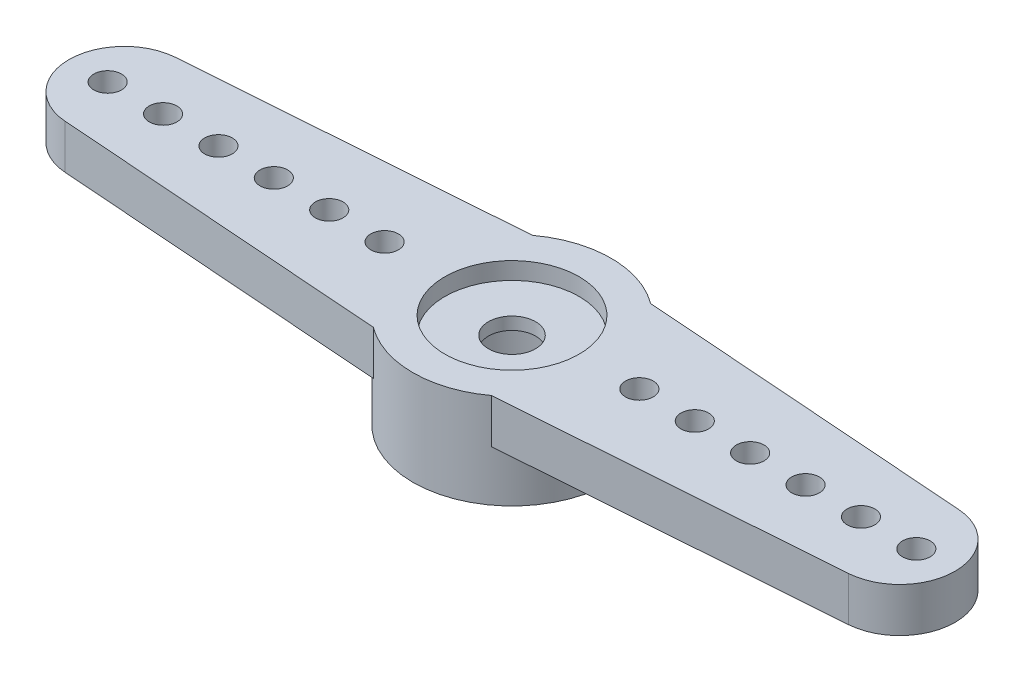
ISO-10303-21;
HEADER;
FILE_DESCRIPTION(('STEP AP214'),'2;1');
FILE_NAME('part.step','',(''),(''),'','','');
FILE_SCHEMA(('AUTOMOTIVE_DESIGN { 1 0 10303 214 1 1 1 1 }'));
ENDSEC;
DATA;
#1=APPLICATION_CONTEXT('core data for automotive mechanical design processes');
#2=APPLICATION_PROTOCOL_DEFINITION('international standard','automotive_design',2000,#1);
#3=PRODUCT_CONTEXT('',#1,'mechanical');
#4=PRODUCT('Part','Part','',(#3));
#5=PRODUCT_RELATED_PRODUCT_CATEGORY('part','',(#4));
#6=PRODUCT_DEFINITION_FORMATION('','',#4);
#7=PRODUCT_DEFINITION_CONTEXT('part definition',#1,'design');
#8=PRODUCT_DEFINITION('design','',#6,#7);
#9=PRODUCT_DEFINITION_SHAPE('','',#8);
#10=(LENGTH_UNIT() NAMED_UNIT(*) SI_UNIT(.MILLI.,.METRE.));
#11=(NAMED_UNIT(*) PLANE_ANGLE_UNIT() SI_UNIT($,.RADIAN.));
#12=(NAMED_UNIT(*) SI_UNIT($,.STERADIAN.) SOLID_ANGLE_UNIT());
#13=UNCERTAINTY_MEASURE_WITH_UNIT(LENGTH_MEASURE(1.E-05),#10,'distance_accuracy_value','');
#14=(GEOMETRIC_REPRESENTATION_CONTEXT(3) GLOBAL_UNCERTAINTY_ASSIGNED_CONTEXT((#13)) GLOBAL_UNIT_ASSIGNED_CONTEXT((#10,
#11,#12)) REPRESENTATION_CONTEXT('',''));
#15=CARTESIAN_POINT('',(0.,0.,0.));
#16=DIRECTION('',(0.,0.,1.));
#17=DIRECTION('',(1.,0.,0.));
#18=AXIS2_PLACEMENT_3D('',#15,#16,#17);
#19=CARTESIAN_POINT('',(3.554,13.2,-3.6));
#20=DIRECTION('',(0.,-1.,0.));
#21=DIRECTION('',(0.,0.,-1.));
#22=AXIS2_PLACEMENT_3D('',#19,#20,#21);
#23=PLANE('',#22);
#24=CARTESIAN_POINT('',(5.9,13.2,-5.9));
#25=DIRECTION('',(0.,1.,0.));
#26=DIRECTION('',(0.,0.,1.));
#27=AXIS2_PLACEMENT_3D('',#24,#25,#26);
#28=CIRCLE('',#27,0.850000000000001);
#29=CARTESIAN_POINT('',(5.9,13.2,-5.05));
#30=VERTEX_POINT('',#29);
#31=EDGE_CURVE('E230',#30,#30,#28,.F.);
#32=ORIENTED_EDGE('',*,*,#31,.F.);
#33=EDGE_LOOP('',(#32));
#34=FACE_BOUND('',#33,.T.);
#35=CARTESIAN_POINT('',(5.9,13.2,-5.9));
#36=DIRECTION('',(0.,-1.,0.));
#37=DIRECTION('',(0.,0.,-1.));
#38=AXIS2_PLACEMENT_3D('',#35,#36,#37);
#39=CIRCLE('',#38,2.3);
#40=CARTESIAN_POINT('',(5.9,13.2,-8.2));
#41=VERTEX_POINT('',#40);
#42=EDGE_CURVE('E21',#41,#41,#39,.F.);
#43=ORIENTED_EDGE('',*,*,#42,.F.);
#44=EDGE_LOOP('',(#43));
#45=FACE_BOUND('',#44,.T.);
#46=ADVANCED_FACE('F17',(#34,#45),#23,.T.);
#47=CARTESIAN_POINT('',(5.9,13.2,-5.9));
#48=DIRECTION('',(0.,-1.,0.));
#49=DIRECTION('',(0.,0.,-1.));
#50=AXIS2_PLACEMENT_3D('',#47,#48,#49);
#51=CYLINDRICAL_SURFACE('',#50,2.3);
#52=ORIENTED_EDGE('',*,*,#42,.T.);
#53=EDGE_LOOP('',(#52));
#54=FACE_BOUND('',#53,.T.);
#55=CARTESIAN_POINT('',(5.9,10.84,-5.9));
#56=DIRECTION('',(0.,-1.,0.));
#57=DIRECTION('',(0.,0.,-1.));
#58=AXIS2_PLACEMENT_3D('',#55,#56,#57);
#59=CIRCLE('',#58,2.3);
#60=CARTESIAN_POINT('',(5.9,10.84,-8.2));
#61=VERTEX_POINT('',#60);
#62=EDGE_CURVE('E228',#61,#61,#59,.F.);
#63=ORIENTED_EDGE('',*,*,#62,.F.);
#64=EDGE_LOOP('',(#63));
#65=FACE_BOUND('',#64,.T.);
#66=ADVANCED_FACE('F237',(#54,#65),#51,.F.);
#67=CARTESIAN_POINT('',(5.9,13.2,-5.9));
#68=DIRECTION('',(0.,1.,0.));
#69=DIRECTION('',(0.,0.,1.));
#70=AXIS2_PLACEMENT_3D('',#67,#68,#69);
#71=CYLINDRICAL_SURFACE('',#70,0.850000000000001);
#72=ORIENTED_EDGE('',*,*,#31,.T.);
#73=EDGE_LOOP('',(#72));
#74=FACE_BOUND('',#73,.T.);
#75=CARTESIAN_POINT('',(5.9,13.65,-5.9));
#76=DIRECTION('',(0.,1.,0.));
#77=DIRECTION('',(0.,0.,1.));
#78=AXIS2_PLACEMENT_3D('',#75,#76,#77);
#79=CIRCLE('',#78,0.850000000000001);
#80=CARTESIAN_POINT('',(5.9,13.65,-5.05));
#81=VERTEX_POINT('',#80);
#82=EDGE_CURVE('E224',#81,#81,#79,.F.);
#83=ORIENTED_EDGE('',*,*,#82,.F.);
#84=EDGE_LOOP('',(#83));
#85=FACE_BOUND('',#84,.T.);
#86=ADVANCED_FACE('F247',(#74,#85),#71,.F.);
#87=CARTESIAN_POINT('',(2.2484,10.84,-2.2484));
#88=DIRECTION('',(0.,-1.,0.));
#89=DIRECTION('',(0.,0.,-1.));
#90=AXIS2_PLACEMENT_3D('',#87,#88,#89);
#91=PLANE('',#90);
#92=ORIENTED_EDGE('',*,*,#62,.T.);
#93=EDGE_LOOP('',(#92));
#94=FACE_BOUND('',#93,.T.);
#95=CARTESIAN_POINT('',(5.9,10.84,-5.9));
#96=DIRECTION('',(0.,1.,0.));
#97=DIRECTION('',(0.,0.,1.));
#98=AXIS2_PLACEMENT_3D('',#95,#96,#97);
#99=CIRCLE('',#98,3.58);
#100=CARTESIAN_POINT('',(5.9,10.84,-2.32));
#101=VERTEX_POINT('',#100);
#102=EDGE_CURVE('E91',#101,#101,#99,.T.);
#103=ORIENTED_EDGE('',*,*,#102,.F.);
#104=EDGE_LOOP('',(#103));
#105=FACE_BOUND('',#104,.T.);
#106=ADVANCED_FACE('F405',(#94,#105),#91,.T.);
#107=CARTESIAN_POINT('',(8.03325455583716,12.67,-3.025));
#108=DIRECTION('',(0.,-1.,0.));
#109=DIRECTION('',(0.,0.,-1.));
#110=AXIS2_PLACEMENT_3D('',#107,#108,#109);
#111=PLANE('',#110);
#112=CARTESIAN_POINT('',(10.5,12.67,-5.9));
#113=DIRECTION('',(0.,-1.,0.));
#114=DIRECTION('',(0.,0.,-1.));
#115=AXIS2_PLACEMENT_3D('',#112,#113,#114);
#116=CIRCLE('',#115,0.500000000000001);
#117=CARTESIAN_POINT('',(10.5,12.67,-6.4));
#118=VERTEX_POINT('',#117);
#119=EDGE_CURVE('E101',#118,#118,#116,.T.);
#120=ORIENTED_EDGE('',*,*,#119,.F.);
#121=EDGE_LOOP('',(#120));
#122=FACE_BOUND('',#121,.T.);
#123=CARTESIAN_POINT('',(14.5,12.67,-5.9));
#124=DIRECTION('',(0.,-1.,0.));
#125=DIRECTION('',(0.,0.,-1.));
#126=AXIS2_PLACEMENT_3D('',#123,#124,#125);
#127=CIRCLE('',#126,0.5);
#128=CARTESIAN_POINT('',(14.5,12.67,-6.4));
#129=VERTEX_POINT('',#128);
#130=EDGE_CURVE('E215',#129,#129,#127,.T.);
#131=ORIENTED_EDGE('',*,*,#130,.F.);
#132=EDGE_LOOP('',(#131));
#133=FACE_BOUND('',#132,.T.);
#134=CARTESIAN_POINT('',(18.5,12.67,-5.9));
#135=DIRECTION('',(0.,-1.,0.));
#136=DIRECTION('',(0.,0.,-1.));
#137=AXIS2_PLACEMENT_3D('',#134,#135,#136);
#138=CIRCLE('',#137,0.499999999999999);
#139=CARTESIAN_POINT('',(18.5,12.67,-6.4));
#140=VERTEX_POINT('',#139);
#141=EDGE_CURVE('E212',#140,#140,#138,.T.);
#142=ORIENTED_EDGE('',*,*,#141,.F.);
#143=EDGE_LOOP('',(#142));
#144=FACE_BOUND('',#143,.T.);
#145=CARTESIAN_POINT('',(20.5,12.67,-5.9));
#146=DIRECTION('',(0.,-1.,0.));
#147=DIRECTION('',(0.,0.,-1.));
#148=AXIS2_PLACEMENT_3D('',#145,#146,#147);
#149=CIRCLE('',#148,0.500000000000002);
#150=CARTESIAN_POINT('',(20.5,12.67,-6.4));
#151=VERTEX_POINT('',#150);
#152=EDGE_CURVE('E209',#151,#151,#149,.T.);
#153=ORIENTED_EDGE('',*,*,#152,.F.);
#154=EDGE_LOOP('',(#153));
#155=FACE_BOUND('',#154,.T.);
#156=CARTESIAN_POINT('',(16.5,12.67,-5.9));
#157=DIRECTION('',(0.,-1.,0.));
#158=DIRECTION('',(0.,0.,-1.));
#159=AXIS2_PLACEMENT_3D('',#156,#157,#158);
#160=CIRCLE('',#159,0.5);
#161=CARTESIAN_POINT('',(16.5,12.67,-6.4));
#162=VERTEX_POINT('',#161);
#163=EDGE_CURVE('E206',#162,#162,#160,.T.);
#164=ORIENTED_EDGE('',*,*,#163,.F.);
#165=EDGE_LOOP('',(#164));
#166=FACE_BOUND('',#165,.T.);
#167=CARTESIAN_POINT('',(12.5,12.67,-5.9));
#168=DIRECTION('',(0.,-1.,0.));
#169=DIRECTION('',(0.,0.,-1.));
#170=AXIS2_PLACEMENT_3D('',#167,#168,#169);
#171=CIRCLE('',#170,0.500000000000001);
#172=CARTESIAN_POINT('',(12.5,12.67,-6.4));
#173=VERTEX_POINT('',#172);
#174=EDGE_CURVE('E203',#173,#173,#171,.T.);
#175=ORIENTED_EDGE('',*,*,#174,.F.);
#176=EDGE_LOOP('',(#175));
#177=FACE_BOUND('',#176,.T.);
#178=DIRECTION('',(-0.997325531387097,0.,-0.0730875122264069));
#179=VECTOR('',#178,1.);
#180=CARTESIAN_POINT('',(14.039714790145,12.67,-8.33482553138709));
#181=LINE('',#180,#179);
#182=CARTESIAN_POINT('',(20.0461750244528,12.67,-7.89465106277419));
#183=VERTEX_POINT('',#182);
#184=CARTESIAN_POINT('',(8.03325455583716,12.67,-8.775));
#185=VERTEX_POINT('',#184);
#186=EDGE_CURVE('E86',#183,#185,#181,.T.);
#187=ORIENTED_EDGE('',*,*,#186,.F.);
#188=CARTESIAN_POINT('',(19.9,12.67,-5.9));
#189=DIRECTION('',(0.,1.,0.));
#190=DIRECTION('',(0.,0.,1.));
#191=AXIS2_PLACEMENT_3D('',#188,#189,#190);
#192=CIRCLE('',#191,2.);
#193=CARTESIAN_POINT('',(20.0461750244528,12.67,-3.9053489372258));
#194=VERTEX_POINT('',#193);
#195=EDGE_CURVE('E105',#194,#183,#192,.T.);
#196=ORIENTED_EDGE('',*,*,#195,.F.);
#197=DIRECTION('',(0.997325531387097,0.,-0.0730875122264059));
#198=VECTOR('',#197,1.);
#199=CARTESIAN_POINT('',(14.039714790145,12.67,-3.4651744686129));
#200=LINE('',#199,#198);
#201=CARTESIAN_POINT('',(8.03325455583716,12.67,-3.025));
#202=VERTEX_POINT('',#201);
#203=EDGE_CURVE('E87',#202,#194,#200,.T.);
#204=ORIENTED_EDGE('',*,*,#203,.F.);
#205=CARTESIAN_POINT('',(5.9,12.67,-5.9));
#206=DIRECTION('',(0.,1.,0.));
#207=DIRECTION('',(0.,0.,1.));
#208=AXIS2_PLACEMENT_3D('',#205,#206,#207);
#209=CIRCLE('',#208,3.58);
#210=EDGE_CURVE('E81',#185,#202,#209,.F.);
#211=ORIENTED_EDGE('',*,*,#210,.F.);
#212=EDGE_LOOP('',(#187,#196,#204,#211));
#213=FACE_BOUND('',#212,.T.);
#214=ADVANCED_FACE('F83',(#122,#133,#144,#155,#166,#177,#213),#111,.T.);
#215=CARTESIAN_POINT('',(3.4265,13.65,-8.325));
#216=DIRECTION('',(0.,1.,0.));
#217=DIRECTION('',(0.,0.,1.));
#218=AXIS2_PLACEMENT_3D('',#215,#216,#217);
#219=PLANE('',#218);
#220=ORIENTED_EDGE('',*,*,#82,.T.);
#221=EDGE_LOOP('',(#220));
#222=FACE_BOUND('',#221,.T.);
#223=CARTESIAN_POINT('',(5.9,13.65,-5.9));
#224=DIRECTION('',(0.,-1.,0.));
#225=DIRECTION('',(0.,0.,-1.));
#226=AXIS2_PLACEMENT_3D('',#223,#224,#225);
#227=CIRCLE('',#226,2.425);
#228=CARTESIAN_POINT('',(5.9,13.65,-8.325));
#229=VERTEX_POINT('',#228);
#230=EDGE_CURVE('E200',#229,#229,#227,.T.);
#231=ORIENTED_EDGE('',*,*,#230,.F.);
#232=EDGE_LOOP('',(#231));
#233=FACE_BOUND('',#232,.T.);
#234=ADVANCED_FACE('F300',(#222,#233),#219,.T.);
#235=CARTESIAN_POINT('',(-8.24617502445281,14.27,-7.8946510627742));
#236=DIRECTION('',(-0.0730875122264059,0.,-0.997325531387097));
#237=DIRECTION('',(0.997325531387097,0.,-0.0730875122264059));
#238=AXIS2_PLACEMENT_3D('',#235,#236,#237);
#239=PLANE('',#238);
#240=DIRECTION('',(0.997325531387097,0.,-0.073087512226406));
#241=VECTOR('',#240,1.);
#242=CARTESIAN_POINT('',(-8.2461750244528,12.67,-7.8946510627742));
#243=LINE('',#242,#241);
#244=CARTESIAN_POINT('',(-8.24617502445281,12.67,-7.8946510627742));
#245=VERTEX_POINT('',#244);
#246=CARTESIAN_POINT('',(3.76674544416284,12.67,-8.775));
#247=VERTEX_POINT('',#246);
#248=EDGE_CURVE('E197',#245,#247,#243,.T.);
#249=ORIENTED_EDGE('',*,*,#248,.F.);
#250=DIRECTION('',(0.,-1.,0.));
#251=VECTOR('',#250,1.);
#252=CARTESIAN_POINT('',(-8.24617502445281,13.47,-7.8946510627742));
#253=LINE('',#252,#251);
#254=CARTESIAN_POINT('',(-8.24617502445281,14.27,-7.8946510627742));
#255=VERTEX_POINT('',#254);
#256=EDGE_CURVE('E227',#255,#245,#253,.T.);
#257=ORIENTED_EDGE('',*,*,#256,.F.);
#258=DIRECTION('',(-0.997325531387097,0.,0.073087512226406));
#259=VECTOR('',#258,1.);
#260=CARTESIAN_POINT('',(3.76674544416284,14.27,-8.775));
#261=LINE('',#260,#259);
#262=CARTESIAN_POINT('',(3.76674544416284,14.27,-8.775));
#263=VERTEX_POINT('',#262);
#264=EDGE_CURVE('E169',#263,#255,#261,.T.);
#265=ORIENTED_EDGE('',*,*,#264,.F.);
#266=DIRECTION('',(0.,1.,0.));
#267=VECTOR('',#266,1.);
#268=CARTESIAN_POINT('',(3.76674544416284,12.555,-8.775));
#269=LINE('',#268,#267);
#270=EDGE_CURVE('E109',#247,#263,#269,.T.);
#271=ORIENTED_EDGE('',*,*,#270,.F.);
#272=EDGE_LOOP('',(#249,#257,#265,#271));
#273=FACE_BOUND('',#272,.T.);
#274=ADVANCED_FACE('F298',(#273),#239,.T.);
#275=CARTESIAN_POINT('',(-8.09999999999999,12.67,-5.9));
#276=DIRECTION('',(0.,1.,0.));
#277=DIRECTION('',(0.,0.,1.));
#278=AXIS2_PLACEMENT_3D('',#275,#276,#277);
#279=CYLINDRICAL_SURFACE('',#278,2.);
#280=CARTESIAN_POINT('',(-8.09999999999999,12.67,-5.9));
#281=DIRECTION('',(0.,1.,0.));
#282=DIRECTION('',(0.,0.,1.));
#283=AXIS2_PLACEMENT_3D('',#280,#281,#282);
#284=CIRCLE('',#283,2.);
#285=CARTESIAN_POINT('',(-8.24617502445281,12.67,-3.90534893722581));
#286=VERTEX_POINT('',#285);
#287=EDGE_CURVE('E188',#286,#245,#284,.F.);
#288=ORIENTED_EDGE('',*,*,#287,.F.);
#289=DIRECTION('',(0.,-1.,0.));
#290=VECTOR('',#289,1.);
#291=CARTESIAN_POINT('',(-8.24617502445281,13.47,-3.90534893722581));
#292=LINE('',#291,#290);
#293=CARTESIAN_POINT('',(-8.24617502445281,14.27,-3.90534893722581));
#294=VERTEX_POINT('',#293);
#295=EDGE_CURVE('E223',#294,#286,#292,.T.);
#296=ORIENTED_EDGE('',*,*,#295,.F.);
#297=CARTESIAN_POINT('',(-8.09999999999999,14.27,-5.9));
#298=DIRECTION('',(0.,1.,0.));
#299=DIRECTION('',(0.,0.,1.));
#300=AXIS2_PLACEMENT_3D('',#297,#298,#299);
#301=CIRCLE('',#300,2.);
#302=EDGE_CURVE('E166',#255,#294,#301,.T.);
#303=ORIENTED_EDGE('',*,*,#302,.F.);
#304=ORIENTED_EDGE('',*,*,#256,.T.);
#305=EDGE_LOOP('',(#288,#296,#303,#304));
#306=FACE_BOUND('',#305,.T.);
#307=ADVANCED_FACE('F286',(#306),#279,.T.);
#308=CARTESIAN_POINT('',(3.76674544416284,14.27,-3.025));
#309=DIRECTION('',(-0.0730875122264067,0.,0.997325531387097));
#310=DIRECTION('',(-0.997325531387097,0.,-0.0730875122264067));
#311=AXIS2_PLACEMENT_3D('',#308,#309,#310);
#312=PLANE('',#311);
#313=DIRECTION('',(-0.997325531387097,0.,-0.0730875122264068));
#314=VECTOR('',#313,1.);
#315=CARTESIAN_POINT('',(3.76674544416284,12.67,-3.025));
#316=LINE('',#315,#314);
#317=CARTESIAN_POINT('',(3.76674544416284,12.67,-3.025));
#318=VERTEX_POINT('',#317);
#319=EDGE_CURVE('E191',#318,#286,#316,.T.);
#320=ORIENTED_EDGE('',*,*,#319,.F.);
#321=DIRECTION('',(0.,-1.,0.));
#322=VECTOR('',#321,1.);
#323=CARTESIAN_POINT('',(3.76674544416284,12.555,-3.025));
#324=LINE('',#323,#322);
#325=CARTESIAN_POINT('',(3.76674544416284,14.27,-3.025));
#326=VERTEX_POINT('',#325);
#327=EDGE_CURVE('E90',#326,#318,#324,.T.);
#328=ORIENTED_EDGE('',*,*,#327,.F.);
#329=DIRECTION('',(0.997325531387097,0.,0.0730875122264067));
#330=VECTOR('',#329,1.);
#331=CARTESIAN_POINT('',(-8.2461750244528,14.27,-3.90534893722581));
#332=LINE('',#331,#330);
#333=EDGE_CURVE('E163',#294,#326,#332,.T.);
#334=ORIENTED_EDGE('',*,*,#333,.F.);
#335=ORIENTED_EDGE('',*,*,#295,.T.);
#336=EDGE_LOOP('',(#320,#328,#334,#335));
#337=FACE_BOUND('',#336,.T.);
#338=ADVANCED_FACE('F279',(#337),#312,.T.);
#339=CARTESIAN_POINT('',(5.9,10.84,-5.9));
#340=DIRECTION('',(0.,1.,0.));
#341=DIRECTION('',(0.,0.,1.));
#342=AXIS2_PLACEMENT_3D('',#339,#340,#341);
#343=CYLINDRICAL_SURFACE('',#342,3.58);
#344=CARTESIAN_POINT('',(5.9,14.27,-5.9));
#345=DIRECTION('',(0.,1.,0.));
#346=DIRECTION('',(0.,0.,1.));
#347=AXIS2_PLACEMENT_3D('',#344,#345,#346);
#348=CIRCLE('',#347,3.58);
#349=CARTESIAN_POINT('',(8.03325455583716,14.27,-8.775));
#350=VERTEX_POINT('',#349);
#351=EDGE_CURVE('E98',#350,#263,#348,.T.);
#352=ORIENTED_EDGE('',*,*,#351,.F.);
#353=DIRECTION('',(0.,1.,0.));
#354=VECTOR('',#353,1.);
#355=CARTESIAN_POINT('',(8.03325455583716,13.47,-8.775));
#356=LINE('',#355,#354);
#357=EDGE_CURVE('E94',#185,#350,#356,.T.);
#358=ORIENTED_EDGE('',*,*,#357,.F.);
#359=ORIENTED_EDGE('',*,*,#210,.T.);
#360=DIRECTION('',(0.,-1.,0.));
#361=VECTOR('',#360,1.);
#362=CARTESIAN_POINT('',(8.03325455583716,13.47,-3.025));
#363=LINE('',#362,#361);
#364=CARTESIAN_POINT('',(8.03325455583716,14.27,-3.025));
#365=VERTEX_POINT('',#364);
#366=EDGE_CURVE('E112',#365,#202,#363,.T.);
#367=ORIENTED_EDGE('',*,*,#366,.F.);
#368=CARTESIAN_POINT('',(5.9,14.27,-5.9));
#369=DIRECTION('',(0.,1.,0.));
#370=DIRECTION('',(0.,0.,1.));
#371=AXIS2_PLACEMENT_3D('',#368,#369,#370);
#372=CIRCLE('',#371,3.58);
#373=EDGE_CURVE('E160',#326,#365,#372,.T.);
#374=ORIENTED_EDGE('',*,*,#373,.F.);
#375=ORIENTED_EDGE('',*,*,#327,.T.);
#376=CARTESIAN_POINT('',(5.9,12.67,-5.9));
#377=DIRECTION('',(0.,1.,0.));
#378=DIRECTION('',(0.,0.,1.));
#379=AXIS2_PLACEMENT_3D('',#376,#377,#378);
#380=CIRCLE('',#379,3.58);
#381=EDGE_CURVE('E194',#247,#318,#380,.T.);
#382=ORIENTED_EDGE('',*,*,#381,.F.);
#383=ORIENTED_EDGE('',*,*,#270,.T.);
#384=EDGE_LOOP('',(#352,#358,#359,#367,#374,#375,#382,#383));
#385=FACE_BOUND('',#384,.T.);
#386=ORIENTED_EDGE('',*,*,#102,.T.);
#387=EDGE_LOOP('',(#386));
#388=FACE_BOUND('',#387,.T.);
#389=ADVANCED_FACE('F95',(#385,#388),#343,.T.);
#390=CARTESIAN_POINT('',(20.0461750244528,14.27,-3.9053489372258));
#391=DIRECTION('',(0.0730875122264059,0.,0.997325531387097));
#392=DIRECTION('',(-0.997325531387097,0.,0.0730875122264059));
#393=AXIS2_PLACEMENT_3D('',#390,#391,#392);
#394=PLANE('',#393);
#395=ORIENTED_EDGE('',*,*,#203,.T.);
#396=DIRECTION('',(0.,-1.,0.));
#397=VECTOR('',#396,1.);
#398=CARTESIAN_POINT('',(20.0461750244528,13.47,-3.9053489372258));
#399=LINE('',#398,#397);
#400=CARTESIAN_POINT('',(20.0461750244528,14.27,-3.9053489372258));
#401=VERTEX_POINT('',#400);
#402=EDGE_CURVE('E111',#401,#194,#399,.T.);
#403=ORIENTED_EDGE('',*,*,#402,.F.);
#404=DIRECTION('',(0.997325531387097,0.,-0.0730875122264058));
#405=VECTOR('',#404,1.);
#406=CARTESIAN_POINT('',(8.03325455583716,14.27,-3.025));
#407=LINE('',#406,#405);
#408=EDGE_CURVE('E157',#365,#401,#407,.T.);
#409=ORIENTED_EDGE('',*,*,#408,.F.);
#410=ORIENTED_EDGE('',*,*,#366,.T.);
#411=EDGE_LOOP('',(#395,#403,#409,#410));
#412=FACE_BOUND('',#411,.T.);
#413=ADVANCED_FACE('F296',(#412),#394,.T.);
#414=CARTESIAN_POINT('',(19.9,12.67,-5.9));
#415=DIRECTION('',(0.,1.,0.));
#416=DIRECTION('',(0.,0.,1.));
#417=AXIS2_PLACEMENT_3D('',#414,#415,#416);
#418=CYLINDRICAL_SURFACE('',#417,2.);
#419=ORIENTED_EDGE('',*,*,#195,.T.);
#420=DIRECTION('',(0.,-1.,0.));
#421=VECTOR('',#420,1.);
#422=CARTESIAN_POINT('',(20.0461750244528,13.47,-7.89465106277419));
#423=LINE('',#422,#421);
#424=CARTESIAN_POINT('',(20.0461750244528,14.27,-7.89465106277419));
#425=VERTEX_POINT('',#424);
#426=EDGE_CURVE('E36',#425,#183,#423,.T.);
#427=ORIENTED_EDGE('',*,*,#426,.F.);
#428=CARTESIAN_POINT('',(19.9,14.27,-5.9));
#429=DIRECTION('',(0.,1.,0.));
#430=DIRECTION('',(0.,0.,1.));
#431=AXIS2_PLACEMENT_3D('',#428,#429,#430);
#432=CIRCLE('',#431,2.);
#433=EDGE_CURVE('E154',#401,#425,#432,.T.);
#434=ORIENTED_EDGE('',*,*,#433,.F.);
#435=ORIENTED_EDGE('',*,*,#402,.T.);
#436=EDGE_LOOP('',(#419,#427,#434,#435));
#437=FACE_BOUND('',#436,.T.);
#438=ADVANCED_FACE('F293',(#437),#418,.T.);
#439=CARTESIAN_POINT('',(8.03325455583716,14.27,-8.775));
#440=DIRECTION('',(0.0730875122264069,0.,-0.997325531387097));
#441=DIRECTION('',(0.997325531387097,0.,0.0730875122264069));
#442=AXIS2_PLACEMENT_3D('',#439,#440,#441);
#443=PLANE('',#442);
#444=ORIENTED_EDGE('',*,*,#186,.T.);
#445=ORIENTED_EDGE('',*,*,#357,.T.);
#446=DIRECTION('',(-0.997325531387097,0.,-0.0730875122264067));
#447=VECTOR('',#446,1.);
#448=CARTESIAN_POINT('',(20.0461750244528,14.27,-7.89465106277419));
#449=LINE('',#448,#447);
#450=EDGE_CURVE('E152',#425,#350,#449,.T.);
#451=ORIENTED_EDGE('',*,*,#450,.F.);
#452=ORIENTED_EDGE('',*,*,#426,.T.);
#453=EDGE_LOOP('',(#444,#445,#451,#452));
#454=FACE_BOUND('',#453,.T.);
#455=ADVANCED_FACE('F103',(#454),#443,.T.);
#456=CARTESIAN_POINT('',(-2.7,14.27,-5.9));
#457=DIRECTION('',(0.,-1.,0.));
#458=DIRECTION('',(0.,0.,-1.));
#459=AXIS2_PLACEMENT_3D('',#456,#457,#458);
#460=CYLINDRICAL_SURFACE('',#459,0.5);
#461=CARTESIAN_POINT('',(-2.7,14.27,-5.9));
#462=DIRECTION('',(0.,-1.,0.));
#463=DIRECTION('',(0.,0.,-1.));
#464=AXIS2_PLACEMENT_3D('',#461,#462,#463);
#465=CIRCLE('',#464,0.5);
#466=CARTESIAN_POINT('',(-2.7,14.27,-6.4));
#467=VERTEX_POINT('',#466);
#468=EDGE_CURVE('E149',#467,#467,#465,.T.);
#469=ORIENTED_EDGE('',*,*,#468,.F.);
#470=EDGE_LOOP('',(#469));
#471=FACE_BOUND('',#470,.T.);
#472=CARTESIAN_POINT('',(-2.7,12.67,-5.9));
#473=DIRECTION('',(0.,-1.,0.));
#474=DIRECTION('',(0.,0.,-1.));
#475=AXIS2_PLACEMENT_3D('',#472,#473,#474);
#476=CIRCLE('',#475,0.5);
#477=CARTESIAN_POINT('',(-2.7,12.67,-6.4));
#478=VERTEX_POINT('',#477);
#479=EDGE_CURVE('E173',#478,#478,#476,.F.);
#480=ORIENTED_EDGE('',*,*,#479,.F.);
#481=EDGE_LOOP('',(#480));
#482=FACE_BOUND('',#481,.T.);
#483=ADVANCED_FACE('F321',(#471,#482),#460,.F.);
#484=CARTESIAN_POINT('',(-6.7,14.27,-5.9));
#485=DIRECTION('',(0.,-1.,0.));
#486=DIRECTION('',(0.,0.,-1.));
#487=AXIS2_PLACEMENT_3D('',#484,#485,#486);
#488=CYLINDRICAL_SURFACE('',#487,0.500000000000001);
#489=CARTESIAN_POINT('',(-6.7,14.27,-5.9));
#490=DIRECTION('',(0.,-1.,0.));
#491=DIRECTION('',(0.,0.,-1.));
#492=AXIS2_PLACEMENT_3D('',#489,#490,#491);
#493=CIRCLE('',#492,0.500000000000001);
#494=CARTESIAN_POINT('',(-6.7,14.27,-6.4));
#495=VERTEX_POINT('',#494);
#496=EDGE_CURVE('E146',#495,#495,#493,.T.);
#497=ORIENTED_EDGE('',*,*,#496,.F.);
#498=EDGE_LOOP('',(#497));
#499=FACE_BOUND('',#498,.T.);
#500=CARTESIAN_POINT('',(-6.7,12.67,-5.9));
#501=DIRECTION('',(0.,-1.,0.));
#502=DIRECTION('',(0.,0.,-1.));
#503=AXIS2_PLACEMENT_3D('',#500,#501,#502);
#504=CIRCLE('',#503,0.500000000000001);
#505=CARTESIAN_POINT('',(-6.7,12.67,-6.4));
#506=VERTEX_POINT('',#505);
#507=EDGE_CURVE('E176',#506,#506,#504,.F.);
#508=ORIENTED_EDGE('',*,*,#507,.F.);
#509=EDGE_LOOP('',(#508));
#510=FACE_BOUND('',#509,.T.);
#511=ADVANCED_FACE('F324',(#499,#510),#488,.F.);
#512=CARTESIAN_POINT('',(-8.7,14.27,-5.9));
#513=DIRECTION('',(0.,-1.,0.));
#514=DIRECTION('',(0.,0.,-1.));
#515=AXIS2_PLACEMENT_3D('',#512,#513,#514);
#516=CYLINDRICAL_SURFACE('',#515,0.500000000000001);
#517=CARTESIAN_POINT('',(-8.7,14.27,-5.9));
#518=DIRECTION('',(0.,-1.,0.));
#519=DIRECTION('',(0.,0.,-1.));
#520=AXIS2_PLACEMENT_3D('',#517,#518,#519);
#521=CIRCLE('',#520,0.500000000000001);
#522=CARTESIAN_POINT('',(-8.7,14.27,-6.4));
#523=VERTEX_POINT('',#522);
#524=EDGE_CURVE('E143',#523,#523,#521,.T.);
#525=ORIENTED_EDGE('',*,*,#524,.F.);
#526=EDGE_LOOP('',(#525));
#527=FACE_BOUND('',#526,.T.);
#528=CARTESIAN_POINT('',(-8.7,12.67,-5.9));
#529=DIRECTION('',(0.,-1.,0.));
#530=DIRECTION('',(0.,0.,-1.));
#531=AXIS2_PLACEMENT_3D('',#528,#529,#530);
#532=CIRCLE('',#531,0.500000000000001);
#533=CARTESIAN_POINT('',(-8.7,12.67,-6.4));
#534=VERTEX_POINT('',#533);
#535=EDGE_CURVE('E179',#534,#534,#532,.F.);
#536=ORIENTED_EDGE('',*,*,#535,.F.);
#537=EDGE_LOOP('',(#536));
#538=FACE_BOUND('',#537,.T.);
#539=ADVANCED_FACE('F328',(#527,#538),#516,.F.);
#540=CARTESIAN_POINT('',(-4.7,14.27,-5.9));
#541=DIRECTION('',(0.,-1.,0.));
#542=DIRECTION('',(0.,0.,-1.));
#543=AXIS2_PLACEMENT_3D('',#540,#541,#542);
#544=CYLINDRICAL_SURFACE('',#543,0.5);
#545=CARTESIAN_POINT('',(-4.7,14.27,-5.9));
#546=DIRECTION('',(0.,-1.,0.));
#547=DIRECTION('',(0.,0.,-1.));
#548=AXIS2_PLACEMENT_3D('',#545,#546,#547);
#549=CIRCLE('',#548,0.5);
#550=CARTESIAN_POINT('',(-4.7,14.27,-6.4));
#551=VERTEX_POINT('',#550);
#552=EDGE_CURVE('E140',#551,#551,#549,.T.);
#553=ORIENTED_EDGE('',*,*,#552,.F.);
#554=EDGE_LOOP('',(#553));
#555=FACE_BOUND('',#554,.T.);
#556=CARTESIAN_POINT('',(-4.7,12.67,-5.9));
#557=DIRECTION('',(0.,-1.,0.));
#558=DIRECTION('',(0.,0.,-1.));
#559=AXIS2_PLACEMENT_3D('',#556,#557,#558);
#560=CIRCLE('',#559,0.5);
#561=CARTESIAN_POINT('',(-4.7,12.67,-6.4));
#562=VERTEX_POINT('',#561);
#563=EDGE_CURVE('E182',#562,#562,#560,.F.);
#564=ORIENTED_EDGE('',*,*,#563,.F.);
#565=EDGE_LOOP('',(#564));
#566=FACE_BOUND('',#565,.T.);
#567=ADVANCED_FACE('F332',(#555,#566),#544,.F.);
#568=CARTESIAN_POINT('',(-0.699999999999997,14.27,-5.9));
#569=DIRECTION('',(0.,-1.,0.));
#570=DIRECTION('',(0.,0.,-1.));
#571=AXIS2_PLACEMENT_3D('',#568,#569,#570);
#572=CYLINDRICAL_SURFACE('',#571,0.500000000000001);
#573=CARTESIAN_POINT('',(-0.699999999999997,14.27,-5.9));
#574=DIRECTION('',(0.,-1.,0.));
#575=DIRECTION('',(0.,0.,-1.));
#576=AXIS2_PLACEMENT_3D('',#573,#574,#575);
#577=CIRCLE('',#576,0.500000000000001);
#578=CARTESIAN_POINT('',(-0.699999999999997,14.27,-6.4));
#579=VERTEX_POINT('',#578);
#580=EDGE_CURVE('E137',#579,#579,#577,.T.);
#581=ORIENTED_EDGE('',*,*,#580,.F.);
#582=EDGE_LOOP('',(#581));
#583=FACE_BOUND('',#582,.T.);
#584=CARTESIAN_POINT('',(-0.699999999999997,12.67,-5.9));
#585=DIRECTION('',(0.,-1.,0.));
#586=DIRECTION('',(0.,0.,-1.));
#587=AXIS2_PLACEMENT_3D('',#584,#585,#586);
#588=CIRCLE('',#587,0.500000000000001);
#589=CARTESIAN_POINT('',(-0.699999999999997,12.67,-6.4));
#590=VERTEX_POINT('',#589);
#591=EDGE_CURVE('E185',#590,#590,#588,.F.);
#592=ORIENTED_EDGE('',*,*,#591,.F.);
#593=EDGE_LOOP('',(#592));
#594=FACE_BOUND('',#593,.T.);
#595=ADVANCED_FACE('F336',(#583,#594),#572,.F.);
#596=CARTESIAN_POINT('',(10.5,14.27,-5.9));
#597=DIRECTION('',(0.,-1.,0.));
#598=DIRECTION('',(0.,0.,-1.));
#599=AXIS2_PLACEMENT_3D('',#596,#597,#598);
#600=CYLINDRICAL_SURFACE('',#599,0.500000000000001);
#601=CARTESIAN_POINT('',(10.5,14.27,-5.9));
#602=DIRECTION('',(0.,-1.,0.));
#603=DIRECTION('',(0.,0.,-1.));
#604=AXIS2_PLACEMENT_3D('',#601,#602,#603);
#605=CIRCLE('',#604,0.500000000000001);
#606=CARTESIAN_POINT('',(10.5,14.27,-6.4));
#607=VERTEX_POINT('',#606);
#608=EDGE_CURVE('E134',#607,#607,#605,.T.);
#609=ORIENTED_EDGE('',*,*,#608,.F.);
#610=EDGE_LOOP('',(#609));
#611=FACE_BOUND('',#610,.T.);
#612=ORIENTED_EDGE('',*,*,#119,.T.);
#613=EDGE_LOOP('',(#612));
#614=FACE_BOUND('',#613,.T.);
#615=ADVANCED_FACE('F340',(#611,#614),#600,.F.);
#616=CARTESIAN_POINT('',(14.5,14.27,-5.9));
#617=DIRECTION('',(0.,-1.,0.));
#618=DIRECTION('',(0.,0.,-1.));
#619=AXIS2_PLACEMENT_3D('',#616,#617,#618);
#620=CYLINDRICAL_SURFACE('',#619,0.5);
#621=CARTESIAN_POINT('',(14.5,14.27,-5.9));
#622=DIRECTION('',(0.,-1.,0.));
#623=DIRECTION('',(0.,0.,-1.));
#624=AXIS2_PLACEMENT_3D('',#621,#622,#623);
#625=CIRCLE('',#624,0.5);
#626=CARTESIAN_POINT('',(14.5,14.27,-6.4));
#627=VERTEX_POINT('',#626);
#628=EDGE_CURVE('E131',#627,#627,#625,.T.);
#629=ORIENTED_EDGE('',*,*,#628,.F.);
#630=EDGE_LOOP('',(#629));
#631=FACE_BOUND('',#630,.T.);
#632=ORIENTED_EDGE('',*,*,#130,.T.);
#633=EDGE_LOOP('',(#632));
#634=FACE_BOUND('',#633,.T.);
#635=ADVANCED_FACE('F344',(#631,#634),#620,.F.);
#636=CARTESIAN_POINT('',(18.5,14.27,-5.9));
#637=DIRECTION('',(0.,-1.,0.));
#638=DIRECTION('',(0.,0.,-1.));
#639=AXIS2_PLACEMENT_3D('',#636,#637,#638);
#640=CYLINDRICAL_SURFACE('',#639,0.499999999999999);
#641=CARTESIAN_POINT('',(18.5,14.27,-5.9));
#642=DIRECTION('',(0.,-1.,0.));
#643=DIRECTION('',(0.,0.,-1.));
#644=AXIS2_PLACEMENT_3D('',#641,#642,#643);
#645=CIRCLE('',#644,0.499999999999999);
#646=CARTESIAN_POINT('',(18.5,14.27,-6.4));
#647=VERTEX_POINT('',#646);
#648=EDGE_CURVE('E128',#647,#647,#645,.T.);
#649=ORIENTED_EDGE('',*,*,#648,.F.);
#650=EDGE_LOOP('',(#649));
#651=FACE_BOUND('',#650,.T.);
#652=ORIENTED_EDGE('',*,*,#141,.T.);
#653=EDGE_LOOP('',(#652));
#654=FACE_BOUND('',#653,.T.);
#655=ADVANCED_FACE('F348',(#651,#654),#640,.F.);
#656=CARTESIAN_POINT('',(20.5,14.27,-5.9));
#657=DIRECTION('',(0.,-1.,0.));
#658=DIRECTION('',(0.,0.,-1.));
#659=AXIS2_PLACEMENT_3D('',#656,#657,#658);
#660=CYLINDRICAL_SURFACE('',#659,0.500000000000002);
#661=CARTESIAN_POINT('',(20.5,14.27,-5.9));
#662=DIRECTION('',(0.,-1.,0.));
#663=DIRECTION('',(0.,0.,-1.));
#664=AXIS2_PLACEMENT_3D('',#661,#662,#663);
#665=CIRCLE('',#664,0.500000000000002);
#666=CARTESIAN_POINT('',(20.5,14.27,-6.4));
#667=VERTEX_POINT('',#666);
#668=EDGE_CURVE('E125',#667,#667,#665,.T.);
#669=ORIENTED_EDGE('',*,*,#668,.F.);
#670=EDGE_LOOP('',(#669));
#671=FACE_BOUND('',#670,.T.);
#672=ORIENTED_EDGE('',*,*,#152,.T.);
#673=EDGE_LOOP('',(#672));
#674=FACE_BOUND('',#673,.T.);
#675=ADVANCED_FACE('F352',(#671,#674),#660,.F.);
#676=CARTESIAN_POINT('',(16.5,14.27,-5.9));
#677=DIRECTION('',(0.,-1.,0.));
#678=DIRECTION('',(0.,0.,-1.));
#679=AXIS2_PLACEMENT_3D('',#676,#677,#678);
#680=CYLINDRICAL_SURFACE('',#679,0.5);
#681=CARTESIAN_POINT('',(16.5,14.27,-5.9));
#682=DIRECTION('',(0.,-1.,0.));
#683=DIRECTION('',(0.,0.,-1.));
#684=AXIS2_PLACEMENT_3D('',#681,#682,#683);
#685=CIRCLE('',#684,0.5);
#686=CARTESIAN_POINT('',(16.5,14.27,-6.4));
#687=VERTEX_POINT('',#686);
#688=EDGE_CURVE('E122',#687,#687,#685,.T.);
#689=ORIENTED_EDGE('',*,*,#688,.F.);
#690=EDGE_LOOP('',(#689));
#691=FACE_BOUND('',#690,.T.);
#692=ORIENTED_EDGE('',*,*,#163,.T.);
#693=EDGE_LOOP('',(#692));
#694=FACE_BOUND('',#693,.T.);
#695=ADVANCED_FACE('F356',(#691,#694),#680,.F.);
#696=CARTESIAN_POINT('',(12.5,14.27,-5.9));
#697=DIRECTION('',(0.,-1.,0.));
#698=DIRECTION('',(0.,0.,-1.));
#699=AXIS2_PLACEMENT_3D('',#696,#697,#698);
#700=CYLINDRICAL_SURFACE('',#699,0.500000000000001);
#701=CARTESIAN_POINT('',(12.5,14.27,-5.9));
#702=DIRECTION('',(0.,-1.,0.));
#703=DIRECTION('',(0.,0.,-1.));
#704=AXIS2_PLACEMENT_3D('',#701,#702,#703);
#705=CIRCLE('',#704,0.500000000000001);
#706=CARTESIAN_POINT('',(12.5,14.27,-6.4));
#707=VERTEX_POINT('',#706);
#708=EDGE_CURVE('E119',#707,#707,#705,.T.);
#709=ORIENTED_EDGE('',*,*,#708,.F.);
#710=EDGE_LOOP('',(#709));
#711=FACE_BOUND('',#710,.T.);
#712=ORIENTED_EDGE('',*,*,#174,.T.);
#713=EDGE_LOOP('',(#712));
#714=FACE_BOUND('',#713,.T.);
#715=ADVANCED_FACE('F360',(#711,#714),#700,.F.);
#716=CARTESIAN_POINT('',(5.9,14.27,-5.9));
#717=DIRECTION('',(0.,-1.,0.));
#718=DIRECTION('',(0.,0.,-1.));
#719=AXIS2_PLACEMENT_3D('',#716,#717,#718);
#720=CYLINDRICAL_SURFACE('',#719,2.425);
#721=ORIENTED_EDGE('',*,*,#230,.T.);
#722=EDGE_LOOP('',(#721));
#723=FACE_BOUND('',#722,.T.);
#724=CARTESIAN_POINT('',(5.9,14.27,-5.9));
#725=DIRECTION('',(0.,-1.,0.));
#726=DIRECTION('',(0.,0.,-1.));
#727=AXIS2_PLACEMENT_3D('',#724,#725,#726);
#728=CIRCLE('',#727,2.425);
#729=CARTESIAN_POINT('',(5.9,14.27,-8.325));
#730=VERTEX_POINT('',#729);
#731=EDGE_CURVE('E116',#730,#730,#728,.T.);
#732=ORIENTED_EDGE('',*,*,#731,.F.);
#733=EDGE_LOOP('',(#732));
#734=FACE_BOUND('',#733,.T.);
#735=ADVANCED_FACE('F263',(#723,#734),#720,.F.);
#736=CARTESIAN_POINT('',(-10.2386674544416,12.67,-3.025));
#737=DIRECTION('',(0.,-1.,0.));
#738=DIRECTION('',(0.,0.,-1.));
#739=AXIS2_PLACEMENT_3D('',#736,#737,#738);
#740=PLANE('',#739);
#741=CARTESIAN_POINT('',(1.3,12.67,-5.9));
#742=DIRECTION('',(0.,-1.,0.));
#743=DIRECTION('',(0.,0.,-1.));
#744=AXIS2_PLACEMENT_3D('',#741,#742,#743);
#745=CIRCLE('',#744,0.5);
#746=CARTESIAN_POINT('',(1.3,12.67,-6.4));
#747=VERTEX_POINT('',#746);
#748=EDGE_CURVE('E27',#747,#747,#745,.T.);
#749=ORIENTED_EDGE('',*,*,#748,.F.);
#750=EDGE_LOOP('',(#749));
#751=FACE_BOUND('',#750,.T.);
#752=ORIENTED_EDGE('',*,*,#479,.T.);
#753=EDGE_LOOP('',(#752));
#754=FACE_BOUND('',#753,.T.);
#755=ORIENTED_EDGE('',*,*,#507,.T.);
#756=EDGE_LOOP('',(#755));
#757=FACE_BOUND('',#756,.T.);
#758=ORIENTED_EDGE('',*,*,#535,.T.);
#759=EDGE_LOOP('',(#758));
#760=FACE_BOUND('',#759,.T.);
#761=ORIENTED_EDGE('',*,*,#563,.T.);
#762=EDGE_LOOP('',(#761));
#763=FACE_BOUND('',#762,.T.);
#764=ORIENTED_EDGE('',*,*,#591,.T.);
#765=EDGE_LOOP('',(#764));
#766=FACE_BOUND('',#765,.T.);
#767=ORIENTED_EDGE('',*,*,#319,.T.);
#768=ORIENTED_EDGE('',*,*,#287,.T.);
#769=ORIENTED_EDGE('',*,*,#248,.T.);
#770=ORIENTED_EDGE('',*,*,#381,.T.);
#771=EDGE_LOOP('',(#767,#768,#769,#770));
#772=FACE_BOUND('',#771,.T.);
#773=ADVANCED_FACE('F255',(#751,#754,#757,#760,#763,#766,#772),#740,.T.);
#774=CARTESIAN_POINT('',(-10.42,14.27,-10.3578782608696));
#775=DIRECTION('',(0.,1.,0.));
#776=DIRECTION('',(0.,0.,1.));
#777=AXIS2_PLACEMENT_3D('',#774,#775,#776);
#778=PLANE('',#777);
#779=ORIENTED_EDGE('',*,*,#731,.T.);
#780=EDGE_LOOP('',(#779));
#781=FACE_BOUND('',#780,.T.);
#782=ORIENTED_EDGE('',*,*,#708,.T.);
#783=EDGE_LOOP('',(#782));
#784=FACE_BOUND('',#783,.T.);
#785=ORIENTED_EDGE('',*,*,#688,.T.);
#786=EDGE_LOOP('',(#785));
#787=FACE_BOUND('',#786,.T.);
#788=ORIENTED_EDGE('',*,*,#668,.T.);
#789=EDGE_LOOP('',(#788));
#790=FACE_BOUND('',#789,.T.);
#791=ORIENTED_EDGE('',*,*,#648,.T.);
#792=EDGE_LOOP('',(#791));
#793=FACE_BOUND('',#792,.T.);
#794=ORIENTED_EDGE('',*,*,#628,.T.);
#795=EDGE_LOOP('',(#794));
#796=FACE_BOUND('',#795,.T.);
#797=ORIENTED_EDGE('',*,*,#608,.T.);
#798=EDGE_LOOP('',(#797));
#799=FACE_BOUND('',#798,.T.);
#800=ORIENTED_EDGE('',*,*,#580,.T.);
#801=EDGE_LOOP('',(#800));
#802=FACE_BOUND('',#801,.T.);
#803=ORIENTED_EDGE('',*,*,#552,.T.);
#804=EDGE_LOOP('',(#803));
#805=FACE_BOUND('',#804,.T.);
#806=ORIENTED_EDGE('',*,*,#524,.T.);
#807=EDGE_LOOP('',(#806));
#808=FACE_BOUND('',#807,.T.);
#809=ORIENTED_EDGE('',*,*,#496,.T.);
#810=EDGE_LOOP('',(#809));
#811=FACE_BOUND('',#810,.T.);
#812=ORIENTED_EDGE('',*,*,#468,.T.);
#813=EDGE_LOOP('',(#812));
#814=FACE_BOUND('',#813,.T.);
#815=CARTESIAN_POINT('',(1.3,14.27,-5.9));
#816=DIRECTION('',(0.,-1.,0.));
#817=DIRECTION('',(0.,0.,-1.));
#818=AXIS2_PLACEMENT_3D('',#815,#816,#817);
#819=CIRCLE('',#818,0.5);
#820=CARTESIAN_POINT('',(1.3,14.27,-6.4));
#821=VERTEX_POINT('',#820);
#822=EDGE_CURVE('E11',#821,#821,#819,.F.);
#823=ORIENTED_EDGE('',*,*,#822,.F.);
#824=EDGE_LOOP('',(#823));
#825=FACE_BOUND('',#824,.T.);
#826=ORIENTED_EDGE('',*,*,#433,.T.);
#827=ORIENTED_EDGE('',*,*,#450,.T.);
#828=ORIENTED_EDGE('',*,*,#351,.T.);
#829=ORIENTED_EDGE('',*,*,#264,.T.);
#830=ORIENTED_EDGE('',*,*,#302,.T.);
#831=ORIENTED_EDGE('',*,*,#333,.T.);
#832=ORIENTED_EDGE('',*,*,#373,.T.);
#833=ORIENTED_EDGE('',*,*,#408,.T.);
#834=EDGE_LOOP('',(#826,#827,#828,#829,#830,#831,#832,#833));
#835=FACE_BOUND('',#834,.T.);
#836=ADVANCED_FACE('F250',(#781,#784,#787,#790,#793,#796,#799,#802,#805,#808,#811,#814,#825,
#835),#778,.T.);
#837=CARTESIAN_POINT('',(1.3,14.27,-5.9));
#838=DIRECTION('',(0.,-1.,0.));
#839=DIRECTION('',(0.,0.,-1.));
#840=AXIS2_PLACEMENT_3D('',#837,#838,#839);
#841=CYLINDRICAL_SURFACE('',#840,0.5);
#842=ORIENTED_EDGE('',*,*,#822,.T.);
#843=EDGE_LOOP('',(#842));
#844=FACE_BOUND('',#843,.T.);
#845=ORIENTED_EDGE('',*,*,#748,.T.);
#846=EDGE_LOOP('',(#845));
#847=FACE_BOUND('',#846,.T.);
#848=ADVANCED_FACE('F19',(#844,#847),#841,.F.);
#849=CLOSED_SHELL('',(#46,#66,#86,#106,#214,#234,#274,#307,#338,#389,#413,#438,#455,#483,#511,
#539,#567,#595,#615,#635,#655,#675,#695,#715,#735,#773,#836,#848));
#850=MANIFOLD_SOLID_BREP('B1',#849);
#851=ADVANCED_BREP_SHAPE_REPRESENTATION('',(#18,#850),#14);
#852=SHAPE_DEFINITION_REPRESENTATION(#9,#851);
ENDSEC;
END-ISO-10303-21;
